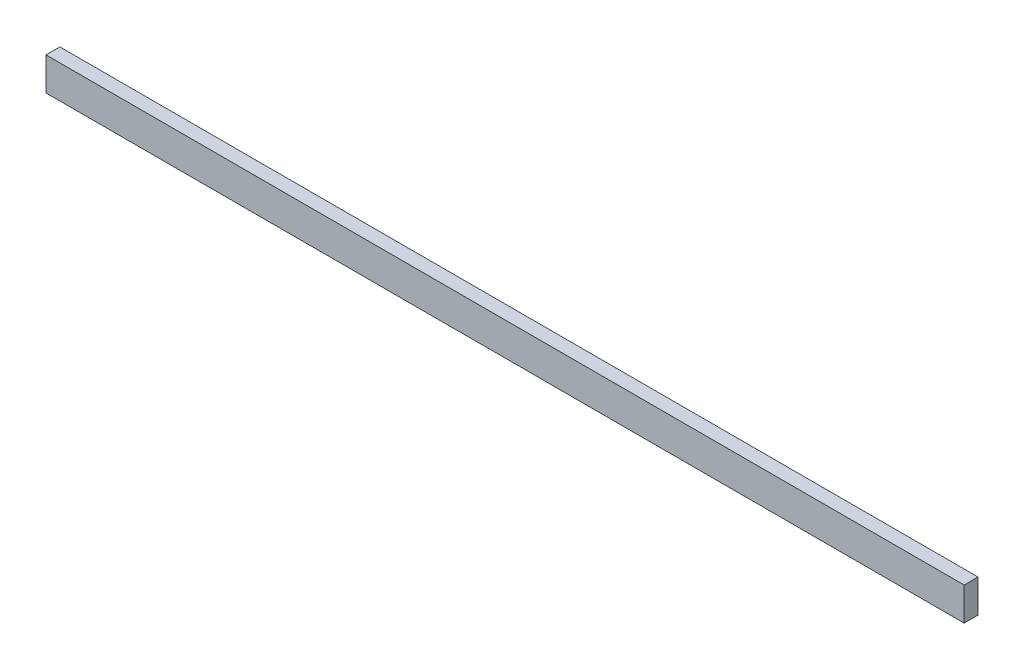
ISO-10303-21;
HEADER;
FILE_DESCRIPTION(('STEP AP214'),'2;1');
FILE_NAME('part.step','',(''),(''),'','','');
FILE_SCHEMA(('AUTOMOTIVE_DESIGN { 1 0 10303 214 1 1 1 1 }'));
ENDSEC;
DATA;
#1=APPLICATION_CONTEXT('core data for automotive mechanical design processes');
#2=APPLICATION_PROTOCOL_DEFINITION('international standard','automotive_design',2000,#1);
#3=PRODUCT_CONTEXT('',#1,'mechanical');
#4=PRODUCT('Part','Part','',(#3));
#5=PRODUCT_RELATED_PRODUCT_CATEGORY('part','',(#4));
#6=PRODUCT_DEFINITION_FORMATION('','',#4);
#7=PRODUCT_DEFINITION_CONTEXT('part definition',#1,'design');
#8=PRODUCT_DEFINITION('design','',#6,#7);
#9=PRODUCT_DEFINITION_SHAPE('','',#8);
#10=(LENGTH_UNIT() NAMED_UNIT(*) SI_UNIT(.MILLI.,.METRE.));
#11=(NAMED_UNIT(*) PLANE_ANGLE_UNIT() SI_UNIT($,.RADIAN.));
#12=(NAMED_UNIT(*) SI_UNIT($,.STERADIAN.) SOLID_ANGLE_UNIT());
#13=UNCERTAINTY_MEASURE_WITH_UNIT(LENGTH_MEASURE(1.E-05),#10,'distance_accuracy_value','');
#14=(GEOMETRIC_REPRESENTATION_CONTEXT(3) GLOBAL_UNCERTAINTY_ASSIGNED_CONTEXT((#13)) GLOBAL_UNIT_ASSIGNED_CONTEXT((#10,
#11,#12)) REPRESENTATION_CONTEXT('',''));
#15=CARTESIAN_POINT('',(0.,0.,0.));
#16=DIRECTION('',(0.,0.,1.));
#17=DIRECTION('',(1.,0.,0.));
#18=AXIS2_PLACEMENT_3D('',#15,#16,#17);
#19=CARTESIAN_POINT('',(0.,0.,3.302));
#20=DIRECTION('',(0.,1.,0.));
#21=DIRECTION('',(0.,0.,1.));
#22=AXIS2_PLACEMENT_3D('',#19,#20,#21);
#23=PLANE('',#22);
#24=DIRECTION('',(1.,0.,0.));
#25=VECTOR('',#24,1.);
#26=CARTESIAN_POINT('',(0.,0.,0.));
#27=LINE('',#26,#25);
#28=CARTESIAN_POINT('',(0.,0.,0.));
#29=VERTEX_POINT('',#28);
#30=CARTESIAN_POINT('',(219.075,0.,0.));
#31=VERTEX_POINT('',#30);
#32=EDGE_CURVE('E99',#29,#31,#27,.T.);
#33=ORIENTED_EDGE('',*,*,#32,.T.);
#34=DIRECTION('',(0.,0.,-1.));
#35=VECTOR('',#34,1.);
#36=CARTESIAN_POINT('',(219.075,0.,3.302));
#37=LINE('',#36,#35);
#38=CARTESIAN_POINT('',(219.075,0.,3.302));
#39=VERTEX_POINT('',#38);
#40=EDGE_CURVE('E11',#39,#31,#37,.T.);
#41=ORIENTED_EDGE('',*,*,#40,.F.);
#42=DIRECTION('',(1.,0.,0.));
#43=VECTOR('',#42,1.);
#44=CARTESIAN_POINT('',(0.,0.,3.302));
#45=LINE('',#44,#43);
#46=CARTESIAN_POINT('',(0.,0.,3.302));
#47=VERTEX_POINT('',#46);
#48=EDGE_CURVE('E85',#47,#39,#45,.T.);
#49=ORIENTED_EDGE('',*,*,#48,.F.);
#50=DIRECTION('',(0.,0.,-1.));
#51=VECTOR('',#50,1.);
#52=CARTESIAN_POINT('',(0.,0.,3.302));
#53=LINE('',#52,#51);
#54=EDGE_CURVE('E52',#47,#29,#53,.T.);
#55=ORIENTED_EDGE('',*,*,#54,.T.);
#56=EDGE_LOOP('',(#33,#41,#49,#55));
#57=FACE_BOUND('',#56,.T.);
#58=ADVANCED_FACE('F36',(#57),#23,.F.);
#59=CARTESIAN_POINT('',(219.075,-7.72231740918708E-13,3.302));
#60=DIRECTION('',(-1.,0.,0.));
#61=DIRECTION('',(0.,-1.,0.));
#62=AXIS2_PLACEMENT_3D('',#59,#60,#61);
#63=PLANE('',#62);
#64=DIRECTION('',(0.,1.,0.));
#65=VECTOR('',#64,1.);
#66=CARTESIAN_POINT('',(219.075,-7.72231740918708E-13,0.));
#67=LINE('',#66,#65);
#68=CARTESIAN_POINT('',(219.075,7.874,0.));
#69=VERTEX_POINT('',#68);
#70=EDGE_CURVE('E90',#31,#69,#67,.T.);
#71=ORIENTED_EDGE('',*,*,#70,.T.);
#72=DIRECTION('',(0.,0.,-1.));
#73=VECTOR('',#72,1.);
#74=CARTESIAN_POINT('',(219.075,7.874,3.302));
#75=LINE('',#74,#73);
#76=CARTESIAN_POINT('',(219.075,7.874,3.302));
#77=VERTEX_POINT('',#76);
#78=EDGE_CURVE('E44',#77,#69,#75,.T.);
#79=ORIENTED_EDGE('',*,*,#78,.F.);
#80=DIRECTION('',(0.,1.,0.));
#81=VECTOR('',#80,1.);
#82=CARTESIAN_POINT('',(219.075,-7.72231740918708E-13,3.302));
#83=LINE('',#82,#81);
#84=EDGE_CURVE('E77',#39,#77,#83,.T.);
#85=ORIENTED_EDGE('',*,*,#84,.F.);
#86=ORIENTED_EDGE('',*,*,#40,.T.);
#87=EDGE_LOOP('',(#71,#79,#85,#86));
#88=FACE_BOUND('',#87,.T.);
#89=ADVANCED_FACE('F89',(#88),#63,.F.);
#90=CARTESIAN_POINT('',(0.,7.874,3.302));
#91=DIRECTION('',(0.,1.,0.));
#92=DIRECTION('',(0.,0.,1.));
#93=AXIS2_PLACEMENT_3D('',#90,#91,#92);
#94=PLANE('',#93);
#95=DIRECTION('',(1.,0.,0.));
#96=VECTOR('',#95,1.);
#97=CARTESIAN_POINT('',(0.,7.874,0.));
#98=LINE('',#97,#96);
#99=CARTESIAN_POINT('',(0.,7.874,0.));
#100=VERTEX_POINT('',#99);
#101=EDGE_CURVE('E102',#100,#69,#98,.T.);
#102=ORIENTED_EDGE('',*,*,#101,.F.);
#103=DIRECTION('',(0.,0.,-1.));
#104=VECTOR('',#103,1.);
#105=CARTESIAN_POINT('',(0.,7.874,3.302));
#106=LINE('',#105,#104);
#107=CARTESIAN_POINT('',(0.,7.874,3.302));
#108=VERTEX_POINT('',#107);
#109=EDGE_CURVE('E66',#108,#100,#106,.T.);
#110=ORIENTED_EDGE('',*,*,#109,.F.);
#111=DIRECTION('',(1.,0.,0.));
#112=VECTOR('',#111,1.);
#113=CARTESIAN_POINT('',(0.,7.874,3.302));
#114=LINE('',#113,#112);
#115=EDGE_CURVE('E84',#108,#77,#114,.T.);
#116=ORIENTED_EDGE('',*,*,#115,.T.);
#117=ORIENTED_EDGE('',*,*,#78,.T.);
#118=EDGE_LOOP('',(#102,#110,#116,#117));
#119=FACE_BOUND('',#118,.T.);
#120=ADVANCED_FACE('F93',(#119),#94,.T.);
#121=CARTESIAN_POINT('',(0.,0.,3.302));
#122=DIRECTION('',(-1.,0.,0.));
#123=DIRECTION('',(0.,-1.,0.));
#124=AXIS2_PLACEMENT_3D('',#121,#122,#123);
#125=PLANE('',#124);
#126=DIRECTION('',(0.,1.,0.));
#127=VECTOR('',#126,1.);
#128=CARTESIAN_POINT('',(0.,0.,0.));
#129=LINE('',#128,#127);
#130=EDGE_CURVE('E104',#29,#100,#129,.T.);
#131=ORIENTED_EDGE('',*,*,#130,.F.);
#132=ORIENTED_EDGE('',*,*,#54,.F.);
#133=DIRECTION('',(0.,1.,0.));
#134=VECTOR('',#133,1.);
#135=CARTESIAN_POINT('',(0.,0.,3.302));
#136=LINE('',#135,#134);
#137=EDGE_CURVE('E94',#47,#108,#136,.T.);
#138=ORIENTED_EDGE('',*,*,#137,.T.);
#139=ORIENTED_EDGE('',*,*,#109,.T.);
#140=EDGE_LOOP('',(#131,#132,#138,#139));
#141=FACE_BOUND('',#140,.T.);
#142=ADVANCED_FACE('F110',(#141),#125,.T.);
#143=CARTESIAN_POINT('',(0.,0.,3.302));
#144=DIRECTION('',(0.,0.,1.));
#145=DIRECTION('',(1.,0.,0.));
#146=AXIS2_PLACEMENT_3D('',#143,#144,#145);
#147=PLANE('',#146);
#148=ORIENTED_EDGE('',*,*,#48,.T.);
#149=ORIENTED_EDGE('',*,*,#84,.T.);
#150=ORIENTED_EDGE('',*,*,#115,.F.);
#151=ORIENTED_EDGE('',*,*,#137,.F.);
#152=EDGE_LOOP('',(#148,#149,#150,#151));
#153=FACE_BOUND('',#152,.T.);
#154=ADVANCED_FACE('F81',(#153),#147,.T.);
#155=CARTESIAN_POINT('',(0.,0.,0.));
#156=DIRECTION('',(0.,0.,1.));
#157=DIRECTION('',(1.,0.,0.));
#158=AXIS2_PLACEMENT_3D('',#155,#156,#157);
#159=PLANE('',#158);
#160=ORIENTED_EDGE('',*,*,#32,.F.);
#161=ORIENTED_EDGE('',*,*,#130,.T.);
#162=ORIENTED_EDGE('',*,*,#101,.T.);
#163=ORIENTED_EDGE('',*,*,#70,.F.);
#164=EDGE_LOOP('',(#160,#161,#162,#163));
#165=FACE_BOUND('',#164,.T.);
#166=ADVANCED_FACE('F109',(#165),#159,.F.);
#167=CLOSED_SHELL('',(#58,#89,#120,#142,#154,#166));
#168=MANIFOLD_SOLID_BREP('B2',#167);
#169=ADVANCED_BREP_SHAPE_REPRESENTATION('',(#18,#168),#14);
#170=SHAPE_DEFINITION_REPRESENTATION(#9,#169);
ENDSEC;
END-ISO-10303-21;
